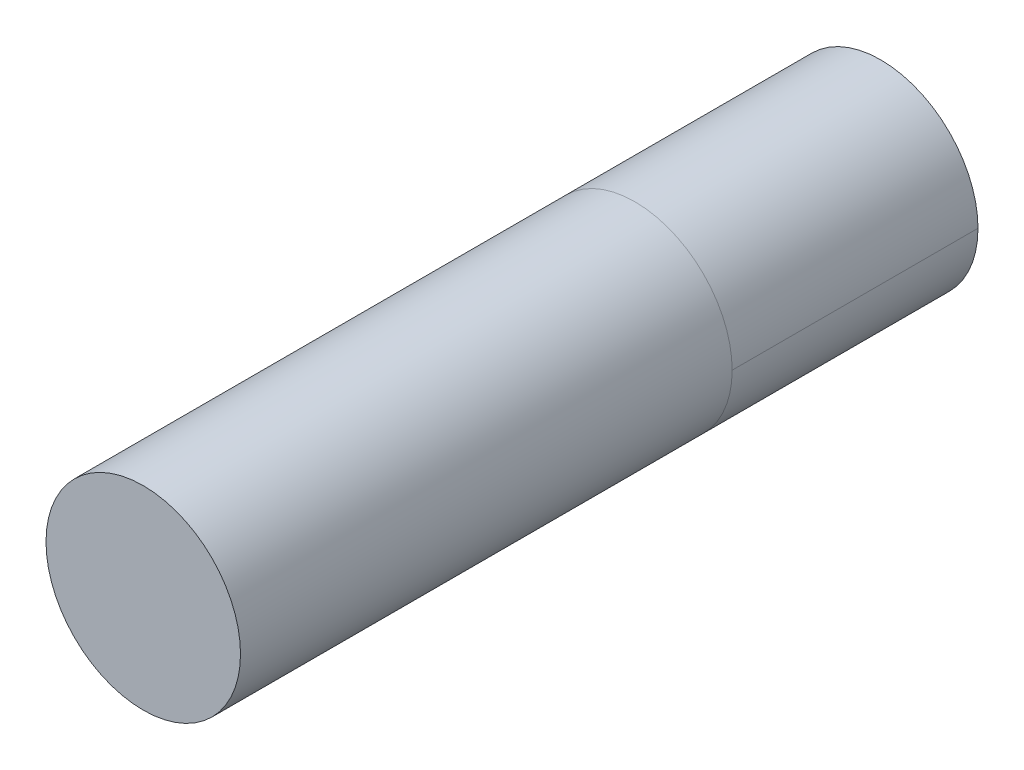
ISO-10303-21;
HEADER;
FILE_DESCRIPTION(('STEP AP214'),'2;1');
FILE_NAME('part.step','',(''),(''),'','','');
FILE_SCHEMA(('AUTOMOTIVE_DESIGN { 1 0 10303 214 1 1 1 1 }'));
ENDSEC;
DATA;
#1=APPLICATION_CONTEXT('core data for automotive mechanical design processes');
#2=APPLICATION_PROTOCOL_DEFINITION('international standard','automotive_design',2000,#1);
#3=PRODUCT_CONTEXT('',#1,'mechanical');
#4=PRODUCT('Part','Part','',(#3));
#5=PRODUCT_RELATED_PRODUCT_CATEGORY('part','',(#4));
#6=PRODUCT_DEFINITION_FORMATION('','',#4);
#7=PRODUCT_DEFINITION_CONTEXT('part definition',#1,'design');
#8=PRODUCT_DEFINITION('design','',#6,#7);
#9=PRODUCT_DEFINITION_SHAPE('','',#8);
#10=(LENGTH_UNIT() NAMED_UNIT(*) SI_UNIT(.MILLI.,.METRE.));
#11=(NAMED_UNIT(*) PLANE_ANGLE_UNIT() SI_UNIT($,.RADIAN.));
#12=(NAMED_UNIT(*) SI_UNIT($,.STERADIAN.) SOLID_ANGLE_UNIT());
#13=UNCERTAINTY_MEASURE_WITH_UNIT(LENGTH_MEASURE(1.E-05),#10,'distance_accuracy_value','');
#14=(GEOMETRIC_REPRESENTATION_CONTEXT(3) GLOBAL_UNCERTAINTY_ASSIGNED_CONTEXT((#13)) GLOBAL_UNIT_ASSIGNED_CONTEXT((#10,
#11,#12)) REPRESENTATION_CONTEXT('',''));
#15=CARTESIAN_POINT('',(0.,0.,0.));
#16=DIRECTION('',(0.,0.,1.));
#17=DIRECTION('',(1.,0.,0.));
#18=AXIS2_PLACEMENT_3D('',#15,#16,#17);
#19=CARTESIAN_POINT('',(0.,0.,9.525));
#20=DIRECTION('',(0.,0.,-1.));
#21=DIRECTION('',(-1.,0.,0.));
#22=AXIS2_PLACEMENT_3D('',#19,#20,#21);
#23=CYLINDRICAL_SURFACE('',#22,1.25603);
#24=CARTESIAN_POINT('',(0.,0.,9.525));
#25=DIRECTION('',(0.,0.,1.));
#26=DIRECTION('',(1.,0.,0.));
#27=AXIS2_PLACEMENT_3D('',#24,#25,#26);
#28=CIRCLE('',#27,1.25603);
#29=CARTESIAN_POINT('',(1.25603,0.,9.525));
#30=VERTEX_POINT('',#29);
#31=EDGE_CURVE('E11',#30,#30,#28,.T.);
#32=ORIENTED_EDGE('',*,*,#31,.F.);
#33=EDGE_LOOP('',(#32));
#34=FACE_BOUND('',#33,.T.);
#35=CARTESIAN_POINT('',(0.,0.,3.175));
#36=DIRECTION('',(0.,0.,1.));
#37=DIRECTION('',(1.,0.,0.));
#38=AXIS2_PLACEMENT_3D('',#35,#36,#37);
#39=CIRCLE('',#38,1.25603);
#40=CARTESIAN_POINT('',(1.25603,0.,3.175));
#41=VERTEX_POINT('',#40);
#42=EDGE_CURVE('E54',#41,#41,#39,.T.);
#43=ORIENTED_EDGE('',*,*,#42,.T.);
#44=EDGE_LOOP('',(#43));
#45=FACE_BOUND('',#44,.T.);
#46=ADVANCED_FACE('F51',(#34,#45),#23,.T.);
#47=CARTESIAN_POINT('',(0.,0.,9.525));
#48=DIRECTION('',(0.,0.,1.));
#49=DIRECTION('',(1.,0.,0.));
#50=AXIS2_PLACEMENT_3D('',#47,#48,#49);
#51=PLANE('',#50);
#52=ORIENTED_EDGE('',*,*,#31,.T.);
#53=EDGE_LOOP('',(#52));
#54=FACE_BOUND('',#53,.T.);
#55=ADVANCED_FACE('F68',(#54),#51,.T.);
#56=CARTESIAN_POINT('',(0.,0.,3.175));
#57=DIRECTION('',(0.,0.,1.));
#58=DIRECTION('',(1.,0.,0.));
#59=AXIS2_PLACEMENT_3D('',#56,#57,#58);
#60=PLANE('',#59);
#61=ORIENTED_EDGE('',*,*,#42,.F.);
#62=EDGE_LOOP('',(#61));
#63=FACE_BOUND('',#62,.T.);
#64=ADVANCED_FACE('F66',(#63),#60,.F.);
#65=CLOSED_SHELL('',(#46,#55,#64));
#66=MANIFOLD_SOLID_BREP('B2',#65);
#67=CARTESIAN_POINT('',(0.,0.,3.175));
#68=DIRECTION('',(0.,0.,-1.));
#69=DIRECTION('',(-1.,0.,0.));
#70=AXIS2_PLACEMENT_3D('',#67,#68,#69);
#71=CYLINDRICAL_SURFACE('',#70,1.25603);
#72=CARTESIAN_POINT('',(0.,0.,3.175));
#73=DIRECTION('',(0.,0.,1.));
#74=DIRECTION('',(1.,0.,0.));
#75=AXIS2_PLACEMENT_3D('',#72,#73,#74);
#76=CIRCLE('',#75,1.25603);
#77=CARTESIAN_POINT('',(-1.25603,0.,3.175));
#78=VERTEX_POINT('',#77);
#79=CARTESIAN_POINT('',(1.25603,0.,3.175));
#80=VERTEX_POINT('',#79);
#81=EDGE_CURVE('E120',#78,#80,#76,.T.);
#82=ORIENTED_EDGE('',*,*,#81,.F.);
#83=DIRECTION('',(0.,0.,-1.));
#84=VECTOR('',#83,1.);
#85=CARTESIAN_POINT('',(-1.25603,0.,3.175));
#86=LINE('',#85,#84);
#87=CARTESIAN_POINT('',(-1.25603,0.,0.));
#88=VERTEX_POINT('',#87);
#89=EDGE_CURVE('E49',#78,#88,#86,.T.);
#90=ORIENTED_EDGE('',*,*,#89,.T.);
#91=CARTESIAN_POINT('',(0.,0.,0.));
#92=DIRECTION('',(0.,0.,1.));
#93=DIRECTION('',(1.,0.,0.));
#94=AXIS2_PLACEMENT_3D('',#91,#92,#93);
#95=CIRCLE('',#94,1.25603);
#96=CARTESIAN_POINT('',(1.25603,0.,0.));
#97=VERTEX_POINT('',#96);
#98=EDGE_CURVE('E127',#88,#97,#95,.T.);
#99=ORIENTED_EDGE('',*,*,#98,.T.);
#100=DIRECTION('',(0.,0.,1.));
#101=VECTOR('',#100,1.);
#102=CARTESIAN_POINT('',(1.25603,0.,3.175));
#103=LINE('',#102,#101);
#104=EDGE_CURVE('E103',#97,#80,#103,.T.);
#105=ORIENTED_EDGE('',*,*,#104,.T.);
#106=EDGE_LOOP('',(#82,#90,#99,#105));
#107=FACE_BOUND('',#106,.T.);
#108=ADVANCED_FACE('F94',(#107),#71,.T.);
#109=ORIENTED_EDGE('',*,*,#89,.F.);
#110=EDGE_CURVE('E123',#80,#78,#76,.T.);
#111=ORIENTED_EDGE('',*,*,#110,.F.);
#112=ORIENTED_EDGE('',*,*,#104,.F.);
#113=EDGE_CURVE('E124',#97,#88,#95,.T.);
#114=ORIENTED_EDGE('',*,*,#113,.T.);
#115=EDGE_LOOP('',(#109,#111,#112,#114));
#116=FACE_BOUND('',#115,.T.);
#117=ADVANCED_FACE('F96',(#116),#71,.T.);
#118=CARTESIAN_POINT('',(0.,0.,3.175));
#119=DIRECTION('',(0.,0.,1.));
#120=DIRECTION('',(1.,0.,0.));
#121=AXIS2_PLACEMENT_3D('',#118,#119,#120);
#122=PLANE('',#121);
#123=ORIENTED_EDGE('',*,*,#110,.T.);
#124=ORIENTED_EDGE('',*,*,#81,.T.);
#125=EDGE_LOOP('',(#123,#124));
#126=FACE_BOUND('',#125,.T.);
#127=ADVANCED_FACE('F122',(#126),#122,.T.);
#128=CARTESIAN_POINT('',(0.,0.,0.));
#129=DIRECTION('',(0.,0.,1.));
#130=DIRECTION('',(1.,0.,0.));
#131=AXIS2_PLACEMENT_3D('',#128,#129,#130);
#132=PLANE('',#131);
#133=ORIENTED_EDGE('',*,*,#113,.F.);
#134=ORIENTED_EDGE('',*,*,#98,.F.);
#135=EDGE_LOOP('',(#133,#134));
#136=FACE_BOUND('',#135,.T.);
#137=ADVANCED_FACE('F132',(#136),#132,.F.);
#138=CLOSED_SHELL('',(#108,#117,#127,#137));
#139=MANIFOLD_SOLID_BREP('B6',#138);
#140=ADVANCED_BREP_SHAPE_REPRESENTATION('',(#18,#66,#139),#14);
#141=SHAPE_DEFINITION_REPRESENTATION(#9,#140);
ENDSEC;
END-ISO-10303-21;
